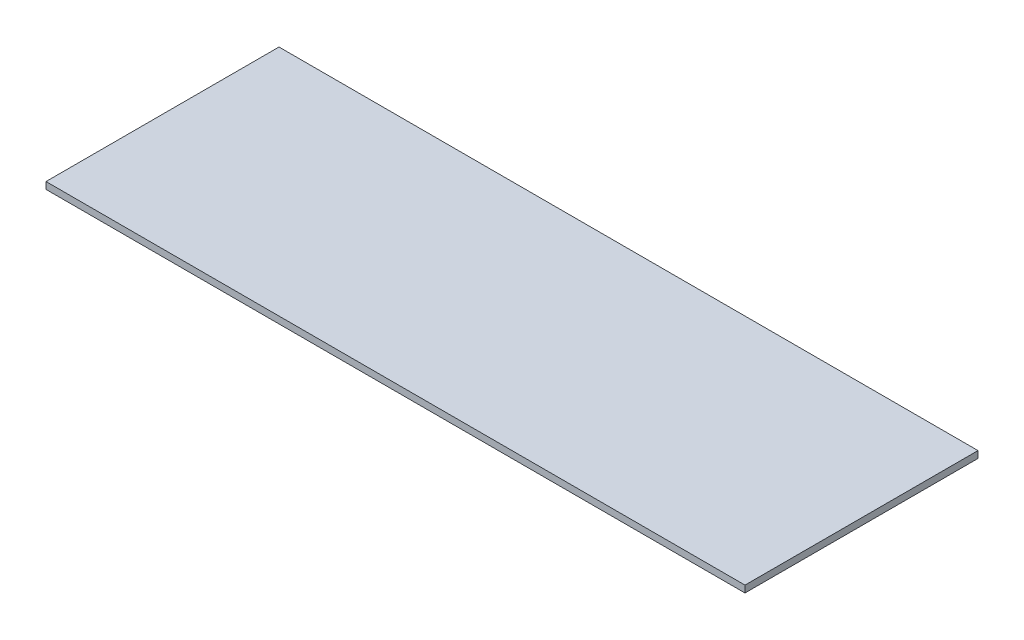
ISO-10303-21;
HEADER;
FILE_DESCRIPTION(('STEP AP214'),'2;1');
FILE_NAME('part.step','',(''),(''),'','','');
FILE_SCHEMA(('AUTOMOTIVE_DESIGN { 1 0 10303 214 1 1 1 1 }'));
ENDSEC;
DATA;
#1=APPLICATION_CONTEXT('core data for automotive mechanical design processes');
#2=APPLICATION_PROTOCOL_DEFINITION('international standard','automotive_design',2000,#1);
#3=PRODUCT_CONTEXT('',#1,'mechanical');
#4=PRODUCT('Part','Part','',(#3));
#5=PRODUCT_RELATED_PRODUCT_CATEGORY('part','',(#4));
#6=PRODUCT_DEFINITION_FORMATION('','',#4);
#7=PRODUCT_DEFINITION_CONTEXT('part definition',#1,'design');
#8=PRODUCT_DEFINITION('design','',#6,#7);
#9=PRODUCT_DEFINITION_SHAPE('','',#8);
#10=(LENGTH_UNIT() NAMED_UNIT(*) SI_UNIT(.MILLI.,.METRE.));
#11=(NAMED_UNIT(*) PLANE_ANGLE_UNIT() SI_UNIT($,.RADIAN.));
#12=(NAMED_UNIT(*) SI_UNIT($,.STERADIAN.) SOLID_ANGLE_UNIT());
#13=UNCERTAINTY_MEASURE_WITH_UNIT(LENGTH_MEASURE(1.E-05),#10,'distance_accuracy_value','');
#14=(GEOMETRIC_REPRESENTATION_CONTEXT(3) GLOBAL_UNCERTAINTY_ASSIGNED_CONTEXT((#13)) GLOBAL_UNIT_ASSIGNED_CONTEXT((#10,
#11,#12)) REPRESENTATION_CONTEXT('',''));
#15=CARTESIAN_POINT('',(0.,0.,0.));
#16=DIRECTION('',(0.,0.,1.));
#17=DIRECTION('',(1.,0.,0.));
#18=AXIS2_PLACEMENT_3D('',#15,#16,#17);
#19=CARTESIAN_POINT('',(0.,0.,17.));
#20=DIRECTION('',(-1.,0.,0.));
#21=DIRECTION('',(0.,-1.,0.));
#22=AXIS2_PLACEMENT_3D('',#19,#20,#21);
#23=PLANE('',#22);
#24=DIRECTION('',(0.,1.,0.));
#25=VECTOR('',#24,1.);
#26=CARTESIAN_POINT('',(0.,0.,0.));
#27=LINE('',#26,#25);
#28=CARTESIAN_POINT('',(0.,-0.5,0.));
#29=VERTEX_POINT('',#28);
#30=CARTESIAN_POINT('',(0.,0.,0.));
#31=VERTEX_POINT('',#30);
#32=EDGE_CURVE('E110',#29,#31,#27,.T.);
#33=ORIENTED_EDGE('',*,*,#32,.T.);
#34=DIRECTION('',(0.,0.,-1.));
#35=VECTOR('',#34,1.);
#36=CARTESIAN_POINT('',(0.,0.,17.));
#37=LINE('',#36,#35);
#38=CARTESIAN_POINT('',(0.,0.,17.));
#39=VERTEX_POINT('',#38);
#40=EDGE_CURVE('E11',#39,#31,#37,.T.);
#41=ORIENTED_EDGE('',*,*,#40,.F.);
#42=DIRECTION('',(0.,1.,0.));
#43=VECTOR('',#42,1.);
#44=CARTESIAN_POINT('',(0.,0.,17.));
#45=LINE('',#44,#43);
#46=CARTESIAN_POINT('',(0.,-0.5,17.));
#47=VERTEX_POINT('',#46);
#48=EDGE_CURVE('E96',#47,#39,#45,.T.);
#49=ORIENTED_EDGE('',*,*,#48,.F.);
#50=DIRECTION('',(0.,0.,-1.));
#51=VECTOR('',#50,1.);
#52=CARTESIAN_POINT('',(0.,-0.5,17.));
#53=LINE('',#52,#51);
#54=EDGE_CURVE('E106',#47,#29,#53,.T.);
#55=ORIENTED_EDGE('',*,*,#54,.T.);
#56=EDGE_LOOP('',(#33,#41,#49,#55));
#57=FACE_BOUND('',#56,.T.);
#58=ADVANCED_FACE('F45',(#57),#23,.F.);
#59=CARTESIAN_POINT('',(0.,0.,17.));
#60=DIRECTION('',(0.,-1.,0.));
#61=DIRECTION('',(1.,0.,0.));
#62=AXIS2_PLACEMENT_3D('',#59,#60,#61);
#63=PLANE('',#62);
#64=DIRECTION('',(-1.,0.,0.));
#65=VECTOR('',#64,1.);
#66=CARTESIAN_POINT('',(0.,0.,0.));
#67=LINE('',#66,#65);
#68=CARTESIAN_POINT('',(-51.,0.,0.));
#69=VERTEX_POINT('',#68);
#70=EDGE_CURVE('E101',#31,#69,#67,.T.);
#71=ORIENTED_EDGE('',*,*,#70,.T.);
#72=DIRECTION('',(0.,0.,-1.));
#73=VECTOR('',#72,1.);
#74=CARTESIAN_POINT('',(-51.,0.,17.));
#75=LINE('',#74,#73);
#76=CARTESIAN_POINT('',(-51.,0.,17.));
#77=VERTEX_POINT('',#76);
#78=EDGE_CURVE('E53',#77,#69,#75,.T.);
#79=ORIENTED_EDGE('',*,*,#78,.F.);
#80=DIRECTION('',(-1.,0.,0.));
#81=VECTOR('',#80,1.);
#82=CARTESIAN_POINT('',(0.,0.,17.));
#83=LINE('',#82,#81);
#84=EDGE_CURVE('E91',#39,#77,#83,.T.);
#85=ORIENTED_EDGE('',*,*,#84,.F.);
#86=ORIENTED_EDGE('',*,*,#40,.T.);
#87=EDGE_LOOP('',(#71,#79,#85,#86));
#88=FACE_BOUND('',#87,.T.);
#89=ADVANCED_FACE('F100',(#88),#63,.F.);
#90=CARTESIAN_POINT('',(-51.,0.,17.));
#91=DIRECTION('',(1.,0.,0.));
#92=DIRECTION('',(0.,0.,-1.));
#93=AXIS2_PLACEMENT_3D('',#90,#91,#92);
#94=PLANE('',#93);
#95=DIRECTION('',(0.,-1.,0.));
#96=VECTOR('',#95,1.);
#97=CARTESIAN_POINT('',(-51.,0.,0.));
#98=LINE('',#97,#96);
#99=CARTESIAN_POINT('',(-51.,-0.500000000000006,0.));
#100=VERTEX_POINT('',#99);
#101=EDGE_CURVE('E78',#69,#100,#98,.T.);
#102=ORIENTED_EDGE('',*,*,#101,.T.);
#103=DIRECTION('',(0.,0.,-1.));
#104=VECTOR('',#103,1.);
#105=CARTESIAN_POINT('',(-51.,-0.500000000000006,17.));
#106=LINE('',#105,#104);
#107=CARTESIAN_POINT('',(-51.,-0.500000000000006,17.));
#108=VERTEX_POINT('',#107);
#109=EDGE_CURVE('E102',#108,#100,#106,.T.);
#110=ORIENTED_EDGE('',*,*,#109,.F.);
#111=DIRECTION('',(0.,-1.,0.));
#112=VECTOR('',#111,1.);
#113=CARTESIAN_POINT('',(-51.,0.,17.));
#114=LINE('',#113,#112);
#115=EDGE_CURVE('E94',#77,#108,#114,.T.);
#116=ORIENTED_EDGE('',*,*,#115,.F.);
#117=ORIENTED_EDGE('',*,*,#78,.T.);
#118=EDGE_LOOP('',(#102,#110,#116,#117));
#119=FACE_BOUND('',#118,.T.);
#120=ADVANCED_FACE('F103',(#119),#94,.F.);
#121=CARTESIAN_POINT('',(0.,-0.5,17.));
#122=DIRECTION('',(0.,1.,0.));
#123=DIRECTION('',(-1.,0.,0.));
#124=AXIS2_PLACEMENT_3D('',#121,#122,#123);
#125=PLANE('',#124);
#126=DIRECTION('',(1.,0.,0.));
#127=VECTOR('',#126,1.);
#128=CARTESIAN_POINT('',(0.,-0.5,0.));
#129=LINE('',#128,#127);
#130=EDGE_CURVE('E84',#100,#29,#129,.T.);
#131=ORIENTED_EDGE('',*,*,#130,.T.);
#132=ORIENTED_EDGE('',*,*,#54,.F.);
#133=DIRECTION('',(1.,0.,0.));
#134=VECTOR('',#133,1.);
#135=CARTESIAN_POINT('',(0.,-0.5,17.));
#136=LINE('',#135,#134);
#137=EDGE_CURVE('E61',#108,#47,#136,.T.);
#138=ORIENTED_EDGE('',*,*,#137,.F.);
#139=ORIENTED_EDGE('',*,*,#109,.T.);
#140=EDGE_LOOP('',(#131,#132,#138,#139));
#141=FACE_BOUND('',#140,.T.);
#142=ADVANCED_FACE('F119',(#141),#125,.F.);
#143=CARTESIAN_POINT('',(0.,0.,17.));
#144=DIRECTION('',(0.,0.,-1.));
#145=DIRECTION('',(-1.,0.,0.));
#146=AXIS2_PLACEMENT_3D('',#143,#144,#145);
#147=PLANE('',#146);
#148=ORIENTED_EDGE('',*,*,#48,.T.);
#149=ORIENTED_EDGE('',*,*,#84,.T.);
#150=ORIENTED_EDGE('',*,*,#115,.T.);
#151=ORIENTED_EDGE('',*,*,#137,.T.);
#152=EDGE_LOOP('',(#148,#149,#150,#151));
#153=FACE_BOUND('',#152,.T.);
#154=ADVANCED_FACE('F92',(#153),#147,.F.);
#155=CARTESIAN_POINT('',(0.,0.,0.));
#156=DIRECTION('',(0.,0.,-1.));
#157=DIRECTION('',(-1.,0.,0.));
#158=AXIS2_PLACEMENT_3D('',#155,#156,#157);
#159=PLANE('',#158);
#160=ORIENTED_EDGE('',*,*,#32,.F.);
#161=ORIENTED_EDGE('',*,*,#130,.F.);
#162=ORIENTED_EDGE('',*,*,#101,.F.);
#163=ORIENTED_EDGE('',*,*,#70,.F.);
#164=EDGE_LOOP('',(#160,#161,#162,#163));
#165=FACE_BOUND('',#164,.T.);
#166=ADVANCED_FACE('F122',(#165),#159,.T.);
#167=CLOSED_SHELL('',(#58,#89,#120,#142,#154,#166));
#168=MANIFOLD_SOLID_BREP('B2',#167);
#169=ADVANCED_BREP_SHAPE_REPRESENTATION('',(#18,#168),#14);
#170=SHAPE_DEFINITION_REPRESENTATION(#9,#169);
ENDSEC;
END-ISO-10303-21;
